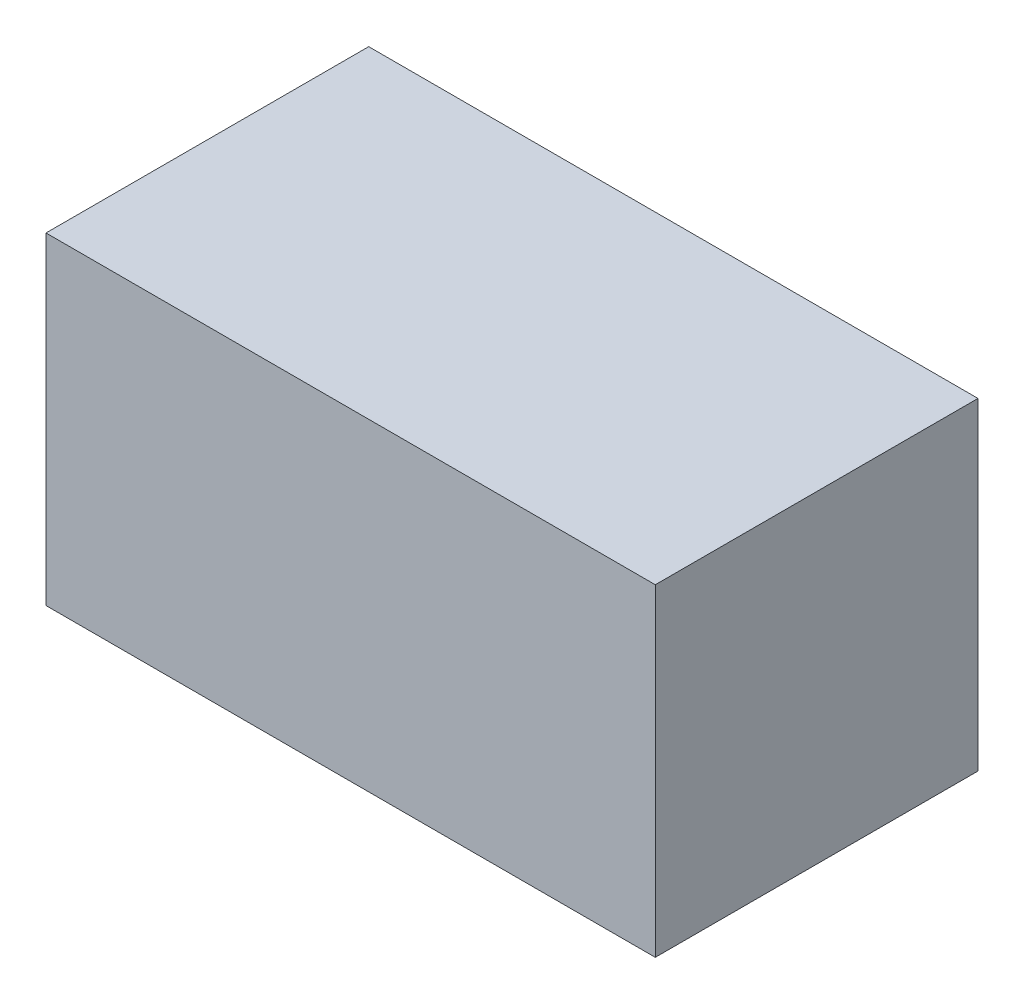
ISO-10303-21;
HEADER;
FILE_DESCRIPTION(('STEP AP214'),'2;1');
FILE_NAME('part.step','',(''),(''),'','','');
FILE_SCHEMA(('AUTOMOTIVE_DESIGN { 1 0 10303 214 1 1 1 1 }'));
ENDSEC;
DATA;
#1=APPLICATION_CONTEXT('core data for automotive mechanical design processes');
#2=APPLICATION_PROTOCOL_DEFINITION('international standard','automotive_design',2000,#1);
#3=PRODUCT_CONTEXT('',#1,'mechanical');
#4=PRODUCT('Part','Part','',(#3));
#5=PRODUCT_RELATED_PRODUCT_CATEGORY('part','',(#4));
#6=PRODUCT_DEFINITION_FORMATION('','',#4);
#7=PRODUCT_DEFINITION_CONTEXT('part definition',#1,'design');
#8=PRODUCT_DEFINITION('design','',#6,#7);
#9=PRODUCT_DEFINITION_SHAPE('','',#8);
#10=(LENGTH_UNIT() NAMED_UNIT(*) SI_UNIT(.MILLI.,.METRE.));
#11=(NAMED_UNIT(*) PLANE_ANGLE_UNIT() SI_UNIT($,.RADIAN.));
#12=(NAMED_UNIT(*) SI_UNIT($,.STERADIAN.) SOLID_ANGLE_UNIT());
#13=UNCERTAINTY_MEASURE_WITH_UNIT(LENGTH_MEASURE(1.E-05),#10,'distance_accuracy_value','');
#14=(GEOMETRIC_REPRESENTATION_CONTEXT(3) GLOBAL_UNCERTAINTY_ASSIGNED_CONTEXT((#13)) GLOBAL_UNIT_ASSIGNED_CONTEXT((#10,
#11,#12)) REPRESENTATION_CONTEXT('',''));
#15=CARTESIAN_POINT('',(0.,0.,0.));
#16=DIRECTION('',(0.,0.,1.));
#17=DIRECTION('',(1.,0.,0.));
#18=AXIS2_PLACEMENT_3D('',#15,#16,#17);
#19=CARTESIAN_POINT('',(1.7145,1.8161,0.90805));
#20=DIRECTION('',(0.,0.,-1.));
#21=DIRECTION('',(0.,1.,0.));
#22=AXIS2_PLACEMENT_3D('',#19,#20,#21);
#23=PLANE('',#22);
#24=DIRECTION('',(0.,-1.,0.));
#25=VECTOR('',#24,1.);
#26=CARTESIAN_POINT('',(-1.7145,1.8161,0.90805));
#27=LINE('',#26,#25);
#28=CARTESIAN_POINT('',(-1.7145,1.8161,0.90805));
#29=VERTEX_POINT('',#28);
#30=CARTESIAN_POINT('',(-1.7145,0.,0.90805));
#31=VERTEX_POINT('',#30);
#32=EDGE_CURVE('E95',#29,#31,#27,.T.);
#33=ORIENTED_EDGE('',*,*,#32,.T.);
#34=DIRECTION('',(-1.,0.,0.));
#35=VECTOR('',#34,1.);
#36=CARTESIAN_POINT('',(1.7145,0.,0.90805));
#37=LINE('',#36,#35);
#38=CARTESIAN_POINT('',(1.7145,0.,0.90805));
#39=VERTEX_POINT('',#38);
#40=EDGE_CURVE('E11',#39,#31,#37,.T.);
#41=ORIENTED_EDGE('',*,*,#40,.F.);
#42=DIRECTION('',(0.,-1.,0.));
#43=VECTOR('',#42,1.);
#44=CARTESIAN_POINT('',(1.7145,1.8161,0.90805));
#45=LINE('',#44,#43);
#46=CARTESIAN_POINT('',(1.7145,1.8161,0.90805));
#47=VERTEX_POINT('',#46);
#48=EDGE_CURVE('E83',#47,#39,#45,.T.);
#49=ORIENTED_EDGE('',*,*,#48,.F.);
#50=DIRECTION('',(-1.,0.,0.));
#51=VECTOR('',#50,1.);
#52=CARTESIAN_POINT('',(1.7145,1.8161,0.90805));
#53=LINE('',#52,#51);
#54=EDGE_CURVE('E91',#47,#29,#53,.T.);
#55=ORIENTED_EDGE('',*,*,#54,.T.);
#56=EDGE_LOOP('',(#33,#41,#49,#55));
#57=FACE_BOUND('',#56,.T.);
#58=ADVANCED_FACE('F32',(#57),#23,.F.);
#59=CARTESIAN_POINT('',(1.7145,0.,0.90805));
#60=DIRECTION('',(0.,1.,0.));
#61=DIRECTION('',(0.,0.,1.));
#62=AXIS2_PLACEMENT_3D('',#59,#60,#61);
#63=PLANE('',#62);
#64=DIRECTION('',(0.,0.,-1.));
#65=VECTOR('',#64,1.);
#66=CARTESIAN_POINT('',(-1.7145,0.,0.90805));
#67=LINE('',#66,#65);
#68=CARTESIAN_POINT('',(-1.7145,0.,-0.90805));
#69=VERTEX_POINT('',#68);
#70=EDGE_CURVE('E87',#31,#69,#67,.T.);
#71=ORIENTED_EDGE('',*,*,#70,.T.);
#72=DIRECTION('',(-1.,0.,0.));
#73=VECTOR('',#72,1.);
#74=CARTESIAN_POINT('',(1.7145,0.,-0.90805));
#75=LINE('',#74,#73);
#76=CARTESIAN_POINT('',(1.7145,0.,-0.90805));
#77=VERTEX_POINT('',#76);
#78=EDGE_CURVE('E40',#77,#69,#75,.T.);
#79=ORIENTED_EDGE('',*,*,#78,.F.);
#80=DIRECTION('',(0.,0.,-1.));
#81=VECTOR('',#80,1.);
#82=CARTESIAN_POINT('',(1.7145,0.,0.90805));
#83=LINE('',#82,#81);
#84=EDGE_CURVE('E78',#39,#77,#83,.T.);
#85=ORIENTED_EDGE('',*,*,#84,.F.);
#86=ORIENTED_EDGE('',*,*,#40,.T.);
#87=EDGE_LOOP('',(#71,#79,#85,#86));
#88=FACE_BOUND('',#87,.T.);
#89=ADVANCED_FACE('F86',(#88),#63,.F.);
#90=CARTESIAN_POINT('',(1.7145,1.8161,-0.90805));
#91=DIRECTION('',(0.,0.,1.));
#92=DIRECTION('',(0.,-1.,0.));
#93=AXIS2_PLACEMENT_3D('',#90,#91,#92);
#94=PLANE('',#93);
#95=DIRECTION('',(0.,1.,0.));
#96=VECTOR('',#95,1.);
#97=CARTESIAN_POINT('',(-1.7145,1.8161,-0.90805));
#98=LINE('',#97,#96);
#99=CARTESIAN_POINT('',(-1.7145,1.8161,-0.90805));
#100=VERTEX_POINT('',#99);
#101=EDGE_CURVE('E65',#69,#100,#98,.T.);
#102=ORIENTED_EDGE('',*,*,#101,.T.);
#103=DIRECTION('',(-1.,0.,0.));
#104=VECTOR('',#103,1.);
#105=CARTESIAN_POINT('',(1.7145,1.8161,-0.90805));
#106=LINE('',#105,#104);
#107=CARTESIAN_POINT('',(1.7145,1.8161,-0.90805));
#108=VERTEX_POINT('',#107);
#109=EDGE_CURVE('E88',#108,#100,#106,.T.);
#110=ORIENTED_EDGE('',*,*,#109,.F.);
#111=DIRECTION('',(0.,1.,0.));
#112=VECTOR('',#111,1.);
#113=CARTESIAN_POINT('',(1.7145,1.8161,-0.90805));
#114=LINE('',#113,#112);
#115=EDGE_CURVE('E81',#77,#108,#114,.T.);
#116=ORIENTED_EDGE('',*,*,#115,.F.);
#117=ORIENTED_EDGE('',*,*,#78,.T.);
#118=EDGE_LOOP('',(#102,#110,#116,#117));
#119=FACE_BOUND('',#118,.T.);
#120=ADVANCED_FACE('F89',(#119),#94,.F.);
#121=CARTESIAN_POINT('',(1.7145,1.8161,0.90805));
#122=DIRECTION('',(0.,-1.,0.));
#123=DIRECTION('',(0.,0.,-1.));
#124=AXIS2_PLACEMENT_3D('',#121,#122,#123);
#125=PLANE('',#124);
#126=DIRECTION('',(0.,0.,1.));
#127=VECTOR('',#126,1.);
#128=CARTESIAN_POINT('',(-1.7145,1.8161,0.90805));
#129=LINE('',#128,#127);
#130=EDGE_CURVE('E71',#100,#29,#129,.T.);
#131=ORIENTED_EDGE('',*,*,#130,.T.);
#132=ORIENTED_EDGE('',*,*,#54,.F.);
#133=DIRECTION('',(0.,0.,1.));
#134=VECTOR('',#133,1.);
#135=CARTESIAN_POINT('',(1.7145,1.8161,0.90805));
#136=LINE('',#135,#134);
#137=EDGE_CURVE('E48',#108,#47,#136,.T.);
#138=ORIENTED_EDGE('',*,*,#137,.F.);
#139=ORIENTED_EDGE('',*,*,#109,.T.);
#140=EDGE_LOOP('',(#131,#132,#138,#139));
#141=FACE_BOUND('',#140,.T.);
#142=ADVANCED_FACE('F102',(#141),#125,.F.);
#143=CARTESIAN_POINT('',(1.7145,0.,0.));
#144=DIRECTION('',(1.,0.,0.));
#145=DIRECTION('',(0.,0.,-1.));
#146=AXIS2_PLACEMENT_3D('',#143,#144,#145);
#147=PLANE('',#146);
#148=ORIENTED_EDGE('',*,*,#48,.T.);
#149=ORIENTED_EDGE('',*,*,#84,.T.);
#150=ORIENTED_EDGE('',*,*,#115,.T.);
#151=ORIENTED_EDGE('',*,*,#137,.T.);
#152=EDGE_LOOP('',(#148,#149,#150,#151));
#153=FACE_BOUND('',#152,.T.);
#154=ADVANCED_FACE('F79',(#153),#147,.T.);
#155=CARTESIAN_POINT('',(-1.7145,0.,0.));
#156=DIRECTION('',(1.,0.,0.));
#157=DIRECTION('',(0.,0.,-1.));
#158=AXIS2_PLACEMENT_3D('',#155,#156,#157);
#159=PLANE('',#158);
#160=ORIENTED_EDGE('',*,*,#32,.F.);
#161=ORIENTED_EDGE('',*,*,#130,.F.);
#162=ORIENTED_EDGE('',*,*,#101,.F.);
#163=ORIENTED_EDGE('',*,*,#70,.F.);
#164=EDGE_LOOP('',(#160,#161,#162,#163));
#165=FACE_BOUND('',#164,.T.);
#166=ADVANCED_FACE('F105',(#165),#159,.F.);
#167=CLOSED_SHELL('',(#58,#89,#120,#142,#154,#166));
#168=MANIFOLD_SOLID_BREP('B2',#167);
#169=ADVANCED_BREP_SHAPE_REPRESENTATION('',(#18,#168),#14);
#170=SHAPE_DEFINITION_REPRESENTATION(#9,#169);
ENDSEC;
END-ISO-10303-21;
